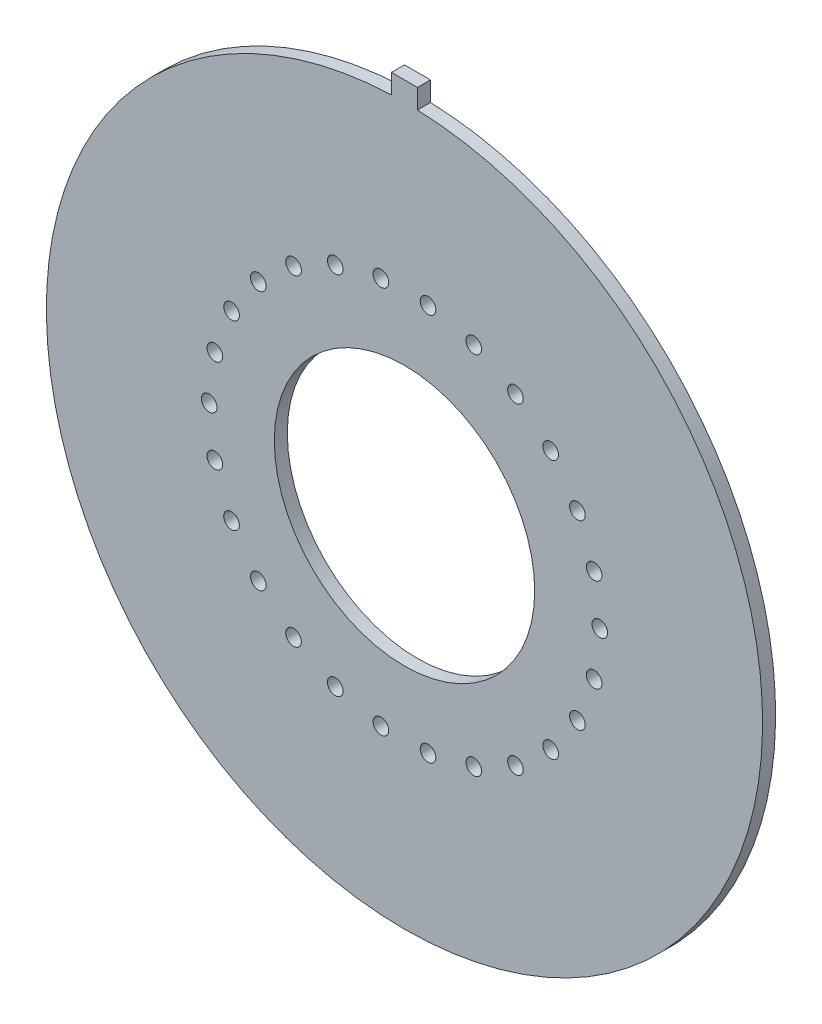
ISO-10303-21;
HEADER;
FILE_DESCRIPTION(('STEP AP214'),'2;1');
FILE_NAME('part.step','',(''),(''),'','','');
FILE_SCHEMA(('AUTOMOTIVE_DESIGN { 1 0 10303 214 1 1 1 1 }'));
ENDSEC;
DATA;
#1=APPLICATION_CONTEXT('core data for automotive mechanical design processes');
#2=APPLICATION_PROTOCOL_DEFINITION('international standard','automotive_design',2000,#1);
#3=PRODUCT_CONTEXT('',#1,'mechanical');
#4=PRODUCT('Part','Part','',(#3));
#5=PRODUCT_RELATED_PRODUCT_CATEGORY('part','',(#4));
#6=PRODUCT_DEFINITION_FORMATION('','',#4);
#7=PRODUCT_DEFINITION_CONTEXT('part definition',#1,'design');
#8=PRODUCT_DEFINITION('design','',#6,#7);
#9=PRODUCT_DEFINITION_SHAPE('','',#8);
#10=(LENGTH_UNIT() NAMED_UNIT(*) SI_UNIT(.MILLI.,.METRE.));
#11=(NAMED_UNIT(*) PLANE_ANGLE_UNIT() SI_UNIT($,.RADIAN.));
#12=(NAMED_UNIT(*) SI_UNIT($,.STERADIAN.) SOLID_ANGLE_UNIT());
#13=UNCERTAINTY_MEASURE_WITH_UNIT(LENGTH_MEASURE(1.E-05),#10,'distance_accuracy_value','');
#14=(GEOMETRIC_REPRESENTATION_CONTEXT(3) GLOBAL_UNCERTAINTY_ASSIGNED_CONTEXT((#13)) GLOBAL_UNIT_ASSIGNED_CONTEXT((#10,
#11,#12)) REPRESENTATION_CONTEXT('',''));
#15=CARTESIAN_POINT('',(0.,0.,0.));
#16=DIRECTION('',(0.,0.,1.));
#17=DIRECTION('',(1.,0.,0.));
#18=AXIS2_PLACEMENT_3D('',#15,#16,#17);
#19=CARTESIAN_POINT('',(0.,0.,1.));
#20=DIRECTION('',(0.,0.,1.));
#21=DIRECTION('',(1.,0.,0.));
#22=AXIS2_PLACEMENT_3D('',#19,#20,#21);
#23=PLANE('',#22);
#24=CARTESIAN_POINT('',(13.2818403847981,6.97084758065654,1.));
#25=DIRECTION('',(0.,0.,1.));
#26=DIRECTION('',(1.,0.,0.));
#27=AXIS2_PLACEMENT_3D('',#24,#25,#26);
#28=CIRCLE('',#27,0.600000000000002);
#29=CARTESIAN_POINT('',(13.8818403847981,6.97084758065654,1.));
#30=VERTEX_POINT('',#29);
#31=EDGE_CURVE('E258',#30,#30,#28,.T.);
#32=ORIENTED_EDGE('',*,*,#31,.F.);
#33=EDGE_LOOP('',(#32));
#34=FACE_BOUND('',#33,.T.);
#35=CARTESIAN_POINT('',(8.52097120096733,12.3447579884048,1.));
#36=DIRECTION('',(0.,0.,1.));
#37=DIRECTION('',(1.,0.,0.));
#38=AXIS2_PLACEMENT_3D('',#35,#36,#37);
#39=CIRCLE('',#38,0.6);
#40=CARTESIAN_POINT('',(9.12097120096733,12.3447579884048,1.));
#41=VERTEX_POINT('',#40);
#42=EDGE_CURVE('E246',#41,#41,#39,.T.);
#43=ORIENTED_EDGE('',*,*,#42,.F.);
#44=EDGE_LOOP('',(#43));
#45=FACE_BOUND('',#44,.T.);
#46=CARTESIAN_POINT('',(1.80805020382983,14.8906331114708,1.));
#47=DIRECTION('',(0.,0.,1.));
#48=DIRECTION('',(1.,0.,0.));
#49=AXIS2_PLACEMENT_3D('',#46,#47,#48);
#50=CIRCLE('',#49,0.599999999999963);
#51=CARTESIAN_POINT('',(2.4080502038298,14.8906331114708,1.));
#52=VERTEX_POINT('',#51);
#53=EDGE_CURVE('E234',#52,#52,#50,.T.);
#54=ORIENTED_EDGE('',*,*,#53,.F.);
#55=EDGE_LOOP('',(#54));
#56=FACE_BOUND('',#55,.T.);
#57=CARTESIAN_POINT('',(-5.31907330563804,14.0252436402812,1.));
#58=DIRECTION('',(0.,0.,1.));
#59=DIRECTION('',(1.,0.,0.));
#60=AXIS2_PLACEMENT_3D('',#57,#58,#59);
#61=CIRCLE('',#60,0.599999999999959);
#62=CARTESIAN_POINT('',(-4.71907330563808,14.0252436402812,1.));
#63=VERTEX_POINT('',#62);
#64=EDGE_CURVE('E222',#63,#63,#61,.T.);
#65=ORIENTED_EDGE('',*,*,#64,.F.);
#66=EDGE_LOOP('',(#65));
#67=FACE_BOUND('',#66,.T.);
#68=CARTESIAN_POINT('',(-11.2276612225665,9.94683987361192,1.));
#69=DIRECTION('',(0.,0.,1.));
#70=DIRECTION('',(1.,0.,0.));
#71=AXIS2_PLACEMENT_3D('',#68,#69,#70);
#72=CIRCLE('',#71,0.599999999999968);
#73=CARTESIAN_POINT('',(-10.6276612225666,9.94683987361192,1.));
#74=VERTEX_POINT('',#73);
#75=EDGE_CURVE('E210',#74,#74,#72,.T.);
#76=ORIENTED_EDGE('',*,*,#75,.F.);
#77=EDGE_LOOP('',(#76));
#78=FACE_BOUND('',#77,.T.);
#79=CARTESIAN_POINT('',(-14.5641272613908,3.58973496431336,1.));
#80=DIRECTION('',(0.,0.,1.));
#81=DIRECTION('',(1.,0.,0.));
#82=AXIS2_PLACEMENT_3D('',#79,#80,#81);
#83=CIRCLE('',#82,0.599999999999977);
#84=CARTESIAN_POINT('',(-13.9641272613908,3.58973496431336,1.));
#85=VERTEX_POINT('',#84);
#86=EDGE_CURVE('E198',#85,#85,#83,.T.);
#87=ORIENTED_EDGE('',*,*,#86,.F.);
#88=EDGE_LOOP('',(#87));
#89=FACE_BOUND('',#88,.T.);
#90=CARTESIAN_POINT('',(-14.5641272613908,-3.58973496431337,1.));
#91=DIRECTION('',(0.,0.,1.));
#92=DIRECTION('',(1.,0.,0.));
#93=AXIS2_PLACEMENT_3D('',#90,#91,#92);
#94=CIRCLE('',#93,0.599999999999973);
#95=CARTESIAN_POINT('',(-13.9641272613908,-3.58973496431337,1.));
#96=VERTEX_POINT('',#95);
#97=EDGE_CURVE('E186',#96,#96,#94,.T.);
#98=ORIENTED_EDGE('',*,*,#97,.F.);
#99=EDGE_LOOP('',(#98));
#100=FACE_BOUND('',#99,.T.);
#101=CARTESIAN_POINT('',(-11.2276612225665,-9.94683987361193,1.));
#102=DIRECTION('',(0.,0.,1.));
#103=DIRECTION('',(1.,0.,0.));
#104=AXIS2_PLACEMENT_3D('',#101,#102,#103);
#105=CIRCLE('',#104,0.599999999999982);
#106=CARTESIAN_POINT('',(-10.6276612225665,-9.94683987361193,1.));
#107=VERTEX_POINT('',#106);
#108=EDGE_CURVE('E174',#107,#107,#105,.T.);
#109=ORIENTED_EDGE('',*,*,#108,.F.);
#110=EDGE_LOOP('',(#109));
#111=FACE_BOUND('',#110,.T.);
#112=CARTESIAN_POINT('',(-5.31907330563803,-14.0252436402812,1.));
#113=DIRECTION('',(0.,0.,1.));
#114=DIRECTION('',(1.,0.,0.));
#115=AXIS2_PLACEMENT_3D('',#112,#113,#114);
#116=CIRCLE('',#115,0.599999999999981);
#117=CARTESIAN_POINT('',(-4.71907330563805,-14.0252436402812,1.));
#118=VERTEX_POINT('',#117);
#119=EDGE_CURVE('E162',#118,#118,#116,.T.);
#120=ORIENTED_EDGE('',*,*,#119,.F.);
#121=EDGE_LOOP('',(#120));
#122=FACE_BOUND('',#121,.T.);
#123=CARTESIAN_POINT('',(1.80805020382985,-14.8906331114708,1.));
#124=DIRECTION('',(0.,0.,1.));
#125=DIRECTION('',(1.,0.,0.));
#126=AXIS2_PLACEMENT_3D('',#123,#124,#125);
#127=CIRCLE('',#126,0.599999999999988);
#128=CARTESIAN_POINT('',(2.40805020382984,-14.8906331114708,1.));
#129=VERTEX_POINT('',#128);
#130=EDGE_CURVE('E150',#129,#129,#127,.T.);
#131=ORIENTED_EDGE('',*,*,#130,.F.);
#132=EDGE_LOOP('',(#131));
#133=FACE_BOUND('',#132,.T.);
#134=CARTESIAN_POINT('',(8.52097120096734,-12.3447579884048,1.));
#135=DIRECTION('',(0.,0.,1.));
#136=DIRECTION('',(1.,0.,0.));
#137=AXIS2_PLACEMENT_3D('',#134,#135,#136);
#138=CIRCLE('',#137,0.600000000000002);
#139=CARTESIAN_POINT('',(9.12097120096734,-12.3447579884048,1.));
#140=VERTEX_POINT('',#139);
#141=EDGE_CURVE('E138',#140,#140,#138,.T.);
#142=ORIENTED_EDGE('',*,*,#141,.F.);
#143=EDGE_LOOP('',(#142));
#144=FACE_BOUND('',#143,.T.);
#145=CARTESIAN_POINT('',(13.2818403847981,-6.97084758065653,1.));
#146=DIRECTION('',(0.,0.,1.));
#147=DIRECTION('',(1.,0.,0.));
#148=AXIS2_PLACEMENT_3D('',#145,#146,#147);
#149=CIRCLE('',#148,0.600000000000002);
#150=CARTESIAN_POINT('',(13.8818403847981,-6.97084758065653,1.));
#151=VERTEX_POINT('',#150);
#152=EDGE_CURVE('E126',#151,#151,#149,.T.);
#153=ORIENTED_EDGE('',*,*,#152,.F.);
#154=EDGE_LOOP('',(#153));
#155=FACE_BOUND('',#154,.T.);
#156=CARTESIAN_POINT('',(0.,0.,1.));
#157=DIRECTION('',(0.,0.,1.));
#158=DIRECTION('',(1.,0.,0.));
#159=AXIS2_PLACEMENT_3D('',#156,#157,#158);
#160=CIRCLE('',#159,10.);
#161=CARTESIAN_POINT('',(10.,0.,1.));
#162=VERTEX_POINT('',#161);
#163=EDGE_CURVE('E114',#162,#162,#160,.T.);
#164=ORIENTED_EDGE('',*,*,#163,.F.);
#165=EDGE_LOOP('',(#164));
#166=FACE_BOUND('',#165,.T.);
#167=CARTESIAN_POINT('',(0.,0.,1.));
#168=DIRECTION('',(0.,0.,1.));
#169=DIRECTION('',(1.,0.,0.));
#170=AXIS2_PLACEMENT_3D('',#167,#168,#169);
#171=CIRCLE('',#170,27.5);
#172=CARTESIAN_POINT('',(-1.,27.4818121673226,1.));
#173=VERTEX_POINT('',#172);
#174=CARTESIAN_POINT('',(1.,27.4818121673226,1.));
#175=VERTEX_POINT('',#174);
#176=EDGE_CURVE('E84',#173,#175,#171,.T.);
#177=ORIENTED_EDGE('',*,*,#176,.T.);
#178=DIRECTION('',(0.,1.,0.));
#179=VECTOR('',#178,1.);
#180=CARTESIAN_POINT('',(1.,28.9818121673226,1.));
#181=LINE('',#180,#179);
#182=CARTESIAN_POINT('',(1.,28.9818121673226,1.));
#183=VERTEX_POINT('',#182);
#184=EDGE_CURVE('E79',#175,#183,#181,.T.);
#185=ORIENTED_EDGE('',*,*,#184,.T.);
#186=DIRECTION('',(-1.,0.,0.));
#187=VECTOR('',#186,1.);
#188=CARTESIAN_POINT('',(-1.,28.9818121673226,1.));
#189=LINE('',#188,#187);
#190=CARTESIAN_POINT('',(-1.,28.9818121673226,1.));
#191=VERTEX_POINT('',#190);
#192=EDGE_CURVE('E82',#183,#191,#189,.T.);
#193=ORIENTED_EDGE('',*,*,#192,.T.);
#194=DIRECTION('',(0.,-1.,0.));
#195=VECTOR('',#194,1.);
#196=CARTESIAN_POINT('',(-1.,27.4818121673226,1.));
#197=LINE('',#196,#195);
#198=EDGE_CURVE('E49',#191,#173,#197,.T.);
#199=ORIENTED_EDGE('',*,*,#198,.T.);
#200=EDGE_LOOP('',(#177,#185,#193,#199));
#201=FACE_BOUND('',#200,.T.);
#202=CARTESIAN_POINT('',(15.,0.,1.));
#203=DIRECTION('',(0.,0.,1.));
#204=DIRECTION('',(1.,0.,0.));
#205=AXIS2_PLACEMENT_3D('',#202,#203,#204);
#206=CIRCLE('',#205,0.6);
#207=CARTESIAN_POINT('',(15.6,0.,1.));
#208=VERTEX_POINT('',#207);
#209=EDGE_CURVE('E99',#208,#208,#206,.T.);
#210=ORIENTED_EDGE('',*,*,#209,.F.);
#211=EDGE_LOOP('',(#210));
#212=FACE_BOUND('',#211,.T.);
#213=CARTESIAN_POINT('',(14.5641272613908,-3.58973496431336,1.));
#214=DIRECTION('',(0.,0.,1.));
#215=DIRECTION('',(1.,0.,0.));
#216=AXIS2_PLACEMENT_3D('',#213,#214,#215);
#217=CIRCLE('',#216,0.600000000000002);
#218=CARTESIAN_POINT('',(15.1641272613908,-3.58973496431336,1.));
#219=VERTEX_POINT('',#218);
#220=EDGE_CURVE('E120',#219,#219,#217,.T.);
#221=ORIENTED_EDGE('',*,*,#220,.F.);
#222=EDGE_LOOP('',(#221));
#223=FACE_BOUND('',#222,.T.);
#224=CARTESIAN_POINT('',(11.2276612225665,-9.94683987361193,1.));
#225=DIRECTION('',(0.,0.,1.));
#226=DIRECTION('',(1.,0.,0.));
#227=AXIS2_PLACEMENT_3D('',#224,#225,#226);
#228=CIRCLE('',#227,0.6);
#229=CARTESIAN_POINT('',(11.8276612225665,-9.94683987361193,1.));
#230=VERTEX_POINT('',#229);
#231=EDGE_CURVE('E132',#230,#230,#228,.T.);
#232=ORIENTED_EDGE('',*,*,#231,.F.);
#233=EDGE_LOOP('',(#232));
#234=FACE_BOUND('',#233,.T.);
#235=CARTESIAN_POINT('',(5.31907330563804,-14.0252436402812,1.));
#236=DIRECTION('',(0.,0.,1.));
#237=DIRECTION('',(1.,0.,0.));
#238=AXIS2_PLACEMENT_3D('',#235,#236,#237);
#239=CIRCLE('',#238,0.6);
#240=CARTESIAN_POINT('',(5.91907330563804,-14.0252436402812,1.));
#241=VERTEX_POINT('',#240);
#242=EDGE_CURVE('E144',#241,#241,#239,.T.);
#243=ORIENTED_EDGE('',*,*,#242,.F.);
#244=EDGE_LOOP('',(#243));
#245=FACE_BOUND('',#244,.T.);
#246=CARTESIAN_POINT('',(-1.80805020382984,-14.8906331114708,1.));
#247=DIRECTION('',(0.,0.,1.));
#248=DIRECTION('',(1.,0.,0.));
#249=AXIS2_PLACEMENT_3D('',#246,#247,#248);
#250=CIRCLE('',#249,0.599999999999983);
#251=CARTESIAN_POINT('',(-1.20805020382986,-14.8906331114708,1.));
#252=VERTEX_POINT('',#251);
#253=EDGE_CURVE('E156',#252,#252,#250,.T.);
#254=ORIENTED_EDGE('',*,*,#253,.F.);
#255=EDGE_LOOP('',(#254));
#256=FACE_BOUND('',#255,.T.);
#257=CARTESIAN_POINT('',(-8.52097120096733,-12.3447579884048,1.));
#258=DIRECTION('',(0.,0.,1.));
#259=DIRECTION('',(1.,0.,0.));
#260=AXIS2_PLACEMENT_3D('',#257,#258,#259);
#261=CIRCLE('',#260,0.599999999999979);
#262=CARTESIAN_POINT('',(-7.92097120096736,-12.3447579884048,1.));
#263=VERTEX_POINT('',#262);
#264=EDGE_CURVE('E168',#263,#263,#261,.T.);
#265=ORIENTED_EDGE('',*,*,#264,.F.);
#266=EDGE_LOOP('',(#265));
#267=FACE_BOUND('',#266,.T.);
#268=CARTESIAN_POINT('',(-13.2818403847981,-6.97084758065653,1.));
#269=DIRECTION('',(0.,0.,1.));
#270=DIRECTION('',(1.,0.,0.));
#271=AXIS2_PLACEMENT_3D('',#268,#269,#270);
#272=CIRCLE('',#271,0.59999999999998);
#273=CARTESIAN_POINT('',(-12.6818403847982,-6.97084758065653,1.));
#274=VERTEX_POINT('',#273);
#275=EDGE_CURVE('E180',#274,#274,#272,.T.);
#276=ORIENTED_EDGE('',*,*,#275,.F.);
#277=EDGE_LOOP('',(#276));
#278=FACE_BOUND('',#277,.T.);
#279=CARTESIAN_POINT('',(-15.,0.,1.));
#280=DIRECTION('',(0.,0.,1.));
#281=DIRECTION('',(1.,0.,0.));
#282=AXIS2_PLACEMENT_3D('',#279,#280,#281);
#283=CIRCLE('',#282,0.599999999999973);
#284=CARTESIAN_POINT('',(-14.4,0.,1.));
#285=VERTEX_POINT('',#284);
#286=EDGE_CURVE('E192',#285,#285,#283,.T.);
#287=ORIENTED_EDGE('',*,*,#286,.F.);
#288=EDGE_LOOP('',(#287));
#289=FACE_BOUND('',#288,.T.);
#290=CARTESIAN_POINT('',(-13.2818403847981,6.97084758065653,1.));
#291=DIRECTION('',(0.,0.,1.));
#292=DIRECTION('',(1.,0.,0.));
#293=AXIS2_PLACEMENT_3D('',#290,#291,#292);
#294=CIRCLE('',#293,0.599999999999973);
#295=CARTESIAN_POINT('',(-12.6818403847982,6.97084758065653,1.));
#296=VERTEX_POINT('',#295);
#297=EDGE_CURVE('E204',#296,#296,#294,.T.);
#298=ORIENTED_EDGE('',*,*,#297,.F.);
#299=EDGE_LOOP('',(#298));
#300=FACE_BOUND('',#299,.T.);
#301=CARTESIAN_POINT('',(-8.52097120096734,12.3447579884048,1.));
#302=DIRECTION('',(0.,0.,1.));
#303=DIRECTION('',(1.,0.,0.));
#304=AXIS2_PLACEMENT_3D('',#301,#302,#303);
#305=CIRCLE('',#304,0.599999999999966);
#306=CARTESIAN_POINT('',(-7.92097120096737,12.3447579884048,1.));
#307=VERTEX_POINT('',#306);
#308=EDGE_CURVE('E216',#307,#307,#305,.T.);
#309=ORIENTED_EDGE('',*,*,#308,.F.);
#310=EDGE_LOOP('',(#309));
#311=FACE_BOUND('',#310,.T.);
#312=CARTESIAN_POINT('',(-1.80805020382985,14.8906331114708,1.));
#313=DIRECTION('',(0.,0.,1.));
#314=DIRECTION('',(1.,0.,0.));
#315=AXIS2_PLACEMENT_3D('',#312,#313,#314);
#316=CIRCLE('',#315,0.599999999999966);
#317=CARTESIAN_POINT('',(-1.20805020382989,14.8906331114708,1.));
#318=VERTEX_POINT('',#317);
#319=EDGE_CURVE('E228',#318,#318,#316,.T.);
#320=ORIENTED_EDGE('',*,*,#319,.F.);
#321=EDGE_LOOP('',(#320));
#322=FACE_BOUND('',#321,.T.);
#323=CARTESIAN_POINT('',(5.31907330563803,14.0252436402812,1.));
#324=DIRECTION('',(0.,0.,1.));
#325=DIRECTION('',(1.,0.,0.));
#326=AXIS2_PLACEMENT_3D('',#323,#324,#325);
#327=CIRCLE('',#326,0.6);
#328=CARTESIAN_POINT('',(5.91907330563803,14.0252436402812,1.));
#329=VERTEX_POINT('',#328);
#330=EDGE_CURVE('E240',#329,#329,#327,.T.);
#331=ORIENTED_EDGE('',*,*,#330,.F.);
#332=EDGE_LOOP('',(#331));
#333=FACE_BOUND('',#332,.T.);
#334=CARTESIAN_POINT('',(11.2276612225665,9.94683987361193,1.));
#335=DIRECTION('',(0.,0.,1.));
#336=DIRECTION('',(1.,0.,0.));
#337=AXIS2_PLACEMENT_3D('',#334,#335,#336);
#338=CIRCLE('',#337,0.6);
#339=CARTESIAN_POINT('',(11.8276612225665,9.94683987361193,1.));
#340=VERTEX_POINT('',#339);
#341=EDGE_CURVE('E252',#340,#340,#338,.T.);
#342=ORIENTED_EDGE('',*,*,#341,.F.);
#343=EDGE_LOOP('',(#342));
#344=FACE_BOUND('',#343,.T.);
#345=CARTESIAN_POINT('',(14.5641272613908,3.58973496431338,1.));
#346=DIRECTION('',(0.,0.,1.));
#347=DIRECTION('',(1.,0.,0.));
#348=AXIS2_PLACEMENT_3D('',#345,#346,#347);
#349=CIRCLE('',#348,0.600000000000002);
#350=CARTESIAN_POINT('',(15.1641272613908,3.58973496431338,1.));
#351=VERTEX_POINT('',#350);
#352=EDGE_CURVE('E264',#351,#351,#349,.T.);
#353=ORIENTED_EDGE('',*,*,#352,.F.);
#354=EDGE_LOOP('',(#353));
#355=FACE_BOUND('',#354,.T.);
#356=ADVANCED_FACE('F32',(#34,#45,#56,#67,#78,#89,#100,#111,#122,#133,#144,#155,#166,#201,#212,
#223,#234,#245,#256,#267,#278,#289,#300,#311,#322,#333,#344,#355),#23,.T.);
#357=CARTESIAN_POINT('',(0.,0.,0.));
#358=DIRECTION('',(0.,0.,1.));
#359=DIRECTION('',(1.,0.,0.));
#360=AXIS2_PLACEMENT_3D('',#357,#358,#359);
#361=PLANE('',#360);
#362=CARTESIAN_POINT('',(13.2818403847981,6.97084758065654,0.));
#363=DIRECTION('',(0.,0.,1.));
#364=DIRECTION('',(1.,0.,0.));
#365=AXIS2_PLACEMENT_3D('',#362,#363,#364);
#366=CIRCLE('',#365,0.600000000000002);
#367=CARTESIAN_POINT('',(13.8818403847981,6.97084758065654,0.));
#368=VERTEX_POINT('',#367);
#369=EDGE_CURVE('E261',#368,#368,#366,.T.);
#370=ORIENTED_EDGE('',*,*,#369,.T.);
#371=EDGE_LOOP('',(#370));
#372=FACE_BOUND('',#371,.T.);
#373=CARTESIAN_POINT('',(8.52097120096733,12.3447579884048,0.));
#374=DIRECTION('',(0.,0.,1.));
#375=DIRECTION('',(1.,0.,0.));
#376=AXIS2_PLACEMENT_3D('',#373,#374,#375);
#377=CIRCLE('',#376,0.6);
#378=CARTESIAN_POINT('',(9.12097120096733,12.3447579884048,0.));
#379=VERTEX_POINT('',#378);
#380=EDGE_CURVE('E249',#379,#379,#377,.T.);
#381=ORIENTED_EDGE('',*,*,#380,.T.);
#382=EDGE_LOOP('',(#381));
#383=FACE_BOUND('',#382,.T.);
#384=CARTESIAN_POINT('',(1.80805020382983,14.8906331114708,0.));
#385=DIRECTION('',(0.,0.,1.));
#386=DIRECTION('',(1.,0.,0.));
#387=AXIS2_PLACEMENT_3D('',#384,#385,#386);
#388=CIRCLE('',#387,0.599999999999963);
#389=CARTESIAN_POINT('',(2.4080502038298,14.8906331114708,0.));
#390=VERTEX_POINT('',#389);
#391=EDGE_CURVE('E237',#390,#390,#388,.T.);
#392=ORIENTED_EDGE('',*,*,#391,.T.);
#393=EDGE_LOOP('',(#392));
#394=FACE_BOUND('',#393,.T.);
#395=CARTESIAN_POINT('',(-5.31907330563804,14.0252436402812,0.));
#396=DIRECTION('',(0.,0.,1.));
#397=DIRECTION('',(1.,0.,0.));
#398=AXIS2_PLACEMENT_3D('',#395,#396,#397);
#399=CIRCLE('',#398,0.599999999999959);
#400=CARTESIAN_POINT('',(-4.71907330563808,14.0252436402812,0.));
#401=VERTEX_POINT('',#400);
#402=EDGE_CURVE('E225',#401,#401,#399,.T.);
#403=ORIENTED_EDGE('',*,*,#402,.T.);
#404=EDGE_LOOP('',(#403));
#405=FACE_BOUND('',#404,.T.);
#406=CARTESIAN_POINT('',(-11.2276612225665,9.94683987361192,0.));
#407=DIRECTION('',(0.,0.,1.));
#408=DIRECTION('',(1.,0.,0.));
#409=AXIS2_PLACEMENT_3D('',#406,#407,#408);
#410=CIRCLE('',#409,0.599999999999968);
#411=CARTESIAN_POINT('',(-10.6276612225666,9.94683987361192,0.));
#412=VERTEX_POINT('',#411);
#413=EDGE_CURVE('E213',#412,#412,#410,.T.);
#414=ORIENTED_EDGE('',*,*,#413,.T.);
#415=EDGE_LOOP('',(#414));
#416=FACE_BOUND('',#415,.T.);
#417=CARTESIAN_POINT('',(-14.5641272613908,3.58973496431336,0.));
#418=DIRECTION('',(0.,0.,1.));
#419=DIRECTION('',(1.,0.,0.));
#420=AXIS2_PLACEMENT_3D('',#417,#418,#419);
#421=CIRCLE('',#420,0.599999999999977);
#422=CARTESIAN_POINT('',(-13.9641272613908,3.58973496431336,0.));
#423=VERTEX_POINT('',#422);
#424=EDGE_CURVE('E201',#423,#423,#421,.T.);
#425=ORIENTED_EDGE('',*,*,#424,.T.);
#426=EDGE_LOOP('',(#425));
#427=FACE_BOUND('',#426,.T.);
#428=CARTESIAN_POINT('',(-14.5641272613908,-3.58973496431337,0.));
#429=DIRECTION('',(0.,0.,1.));
#430=DIRECTION('',(1.,0.,0.));
#431=AXIS2_PLACEMENT_3D('',#428,#429,#430);
#432=CIRCLE('',#431,0.599999999999973);
#433=CARTESIAN_POINT('',(-13.9641272613908,-3.58973496431337,0.));
#434=VERTEX_POINT('',#433);
#435=EDGE_CURVE('E189',#434,#434,#432,.T.);
#436=ORIENTED_EDGE('',*,*,#435,.T.);
#437=EDGE_LOOP('',(#436));
#438=FACE_BOUND('',#437,.T.);
#439=CARTESIAN_POINT('',(-11.2276612225665,-9.94683987361193,0.));
#440=DIRECTION('',(0.,0.,1.));
#441=DIRECTION('',(1.,0.,0.));
#442=AXIS2_PLACEMENT_3D('',#439,#440,#441);
#443=CIRCLE('',#442,0.599999999999982);
#444=CARTESIAN_POINT('',(-10.6276612225665,-9.94683987361193,0.));
#445=VERTEX_POINT('',#444);
#446=EDGE_CURVE('E177',#445,#445,#443,.T.);
#447=ORIENTED_EDGE('',*,*,#446,.T.);
#448=EDGE_LOOP('',(#447));
#449=FACE_BOUND('',#448,.T.);
#450=CARTESIAN_POINT('',(-5.31907330563803,-14.0252436402812,0.));
#451=DIRECTION('',(0.,0.,1.));
#452=DIRECTION('',(1.,0.,0.));
#453=AXIS2_PLACEMENT_3D('',#450,#451,#452);
#454=CIRCLE('',#453,0.599999999999981);
#455=CARTESIAN_POINT('',(-4.71907330563805,-14.0252436402812,0.));
#456=VERTEX_POINT('',#455);
#457=EDGE_CURVE('E165',#456,#456,#454,.T.);
#458=ORIENTED_EDGE('',*,*,#457,.T.);
#459=EDGE_LOOP('',(#458));
#460=FACE_BOUND('',#459,.T.);
#461=CARTESIAN_POINT('',(1.80805020382985,-14.8906331114708,0.));
#462=DIRECTION('',(0.,0.,1.));
#463=DIRECTION('',(1.,0.,0.));
#464=AXIS2_PLACEMENT_3D('',#461,#462,#463);
#465=CIRCLE('',#464,0.599999999999988);
#466=CARTESIAN_POINT('',(2.40805020382984,-14.8906331114708,0.));
#467=VERTEX_POINT('',#466);
#468=EDGE_CURVE('E153',#467,#467,#465,.T.);
#469=ORIENTED_EDGE('',*,*,#468,.T.);
#470=EDGE_LOOP('',(#469));
#471=FACE_BOUND('',#470,.T.);
#472=CARTESIAN_POINT('',(8.52097120096734,-12.3447579884048,0.));
#473=DIRECTION('',(0.,0.,1.));
#474=DIRECTION('',(1.,0.,0.));
#475=AXIS2_PLACEMENT_3D('',#472,#473,#474);
#476=CIRCLE('',#475,0.600000000000002);
#477=CARTESIAN_POINT('',(9.12097120096734,-12.3447579884048,0.));
#478=VERTEX_POINT('',#477);
#479=EDGE_CURVE('E141',#478,#478,#476,.T.);
#480=ORIENTED_EDGE('',*,*,#479,.T.);
#481=EDGE_LOOP('',(#480));
#482=FACE_BOUND('',#481,.T.);
#483=CARTESIAN_POINT('',(13.2818403847981,-6.97084758065653,0.));
#484=DIRECTION('',(0.,0.,1.));
#485=DIRECTION('',(1.,0.,0.));
#486=AXIS2_PLACEMENT_3D('',#483,#484,#485);
#487=CIRCLE('',#486,0.600000000000002);
#488=CARTESIAN_POINT('',(13.8818403847981,-6.97084758065653,0.));
#489=VERTEX_POINT('',#488);
#490=EDGE_CURVE('E129',#489,#489,#487,.T.);
#491=ORIENTED_EDGE('',*,*,#490,.T.);
#492=EDGE_LOOP('',(#491));
#493=FACE_BOUND('',#492,.T.);
#494=CARTESIAN_POINT('',(0.,0.,0.));
#495=DIRECTION('',(0.,0.,1.));
#496=DIRECTION('',(1.,0.,0.));
#497=AXIS2_PLACEMENT_3D('',#494,#495,#496);
#498=CIRCLE('',#497,10.);
#499=CARTESIAN_POINT('',(10.,0.,0.));
#500=VERTEX_POINT('',#499);
#501=EDGE_CURVE('E117',#500,#500,#498,.T.);
#502=ORIENTED_EDGE('',*,*,#501,.T.);
#503=EDGE_LOOP('',(#502));
#504=FACE_BOUND('',#503,.T.);
#505=CARTESIAN_POINT('',(0.,0.,0.));
#506=DIRECTION('',(0.,0.,1.));
#507=DIRECTION('',(1.,0.,0.));
#508=AXIS2_PLACEMENT_3D('',#505,#506,#507);
#509=CIRCLE('',#508,27.5);
#510=CARTESIAN_POINT('',(-1.,27.4818121673226,0.));
#511=VERTEX_POINT('',#510);
#512=CARTESIAN_POINT('',(1.,27.4818121673226,0.));
#513=VERTEX_POINT('',#512);
#514=EDGE_CURVE('E96',#511,#513,#509,.T.);
#515=ORIENTED_EDGE('',*,*,#514,.F.);
#516=DIRECTION('',(0.,-1.,0.));
#517=VECTOR('',#516,1.);
#518=CARTESIAN_POINT('',(-1.,27.4818121673226,0.));
#519=LINE('',#518,#517);
#520=CARTESIAN_POINT('',(-1.,28.9818121673226,0.));
#521=VERTEX_POINT('',#520);
#522=EDGE_CURVE('E72',#521,#511,#519,.T.);
#523=ORIENTED_EDGE('',*,*,#522,.F.);
#524=DIRECTION('',(-1.,0.,0.));
#525=VECTOR('',#524,1.);
#526=CARTESIAN_POINT('',(-1.,28.9818121673226,0.));
#527=LINE('',#526,#525);
#528=CARTESIAN_POINT('',(1.,28.9818121673226,0.));
#529=VERTEX_POINT('',#528);
#530=EDGE_CURVE('E66',#529,#521,#527,.T.);
#531=ORIENTED_EDGE('',*,*,#530,.F.);
#532=DIRECTION('',(0.,1.,0.));
#533=VECTOR('',#532,1.);
#534=CARTESIAN_POINT('',(1.,28.9818121673226,0.));
#535=LINE('',#534,#533);
#536=EDGE_CURVE('E88',#513,#529,#535,.T.);
#537=ORIENTED_EDGE('',*,*,#536,.F.);
#538=EDGE_LOOP('',(#515,#523,#531,#537));
#539=FACE_BOUND('',#538,.T.);
#540=CARTESIAN_POINT('',(15.,0.,0.));
#541=DIRECTION('',(0.,0.,1.));
#542=DIRECTION('',(1.,0.,0.));
#543=AXIS2_PLACEMENT_3D('',#540,#541,#542);
#544=CIRCLE('',#543,0.6);
#545=CARTESIAN_POINT('',(15.6,0.,0.));
#546=VERTEX_POINT('',#545);
#547=EDGE_CURVE('E111',#546,#546,#544,.T.);
#548=ORIENTED_EDGE('',*,*,#547,.T.);
#549=EDGE_LOOP('',(#548));
#550=FACE_BOUND('',#549,.T.);
#551=CARTESIAN_POINT('',(14.5641272613908,-3.58973496431336,0.));
#552=DIRECTION('',(0.,0.,1.));
#553=DIRECTION('',(1.,0.,0.));
#554=AXIS2_PLACEMENT_3D('',#551,#552,#553);
#555=CIRCLE('',#554,0.600000000000002);
#556=CARTESIAN_POINT('',(15.1641272613908,-3.58973496431336,0.));
#557=VERTEX_POINT('',#556);
#558=EDGE_CURVE('E123',#557,#557,#555,.T.);
#559=ORIENTED_EDGE('',*,*,#558,.T.);
#560=EDGE_LOOP('',(#559));
#561=FACE_BOUND('',#560,.T.);
#562=CARTESIAN_POINT('',(11.2276612225665,-9.94683987361193,0.));
#563=DIRECTION('',(0.,0.,1.));
#564=DIRECTION('',(1.,0.,0.));
#565=AXIS2_PLACEMENT_3D('',#562,#563,#564);
#566=CIRCLE('',#565,0.6);
#567=CARTESIAN_POINT('',(11.8276612225665,-9.94683987361193,0.));
#568=VERTEX_POINT('',#567);
#569=EDGE_CURVE('E135',#568,#568,#566,.T.);
#570=ORIENTED_EDGE('',*,*,#569,.T.);
#571=EDGE_LOOP('',(#570));
#572=FACE_BOUND('',#571,.T.);
#573=CARTESIAN_POINT('',(5.31907330563804,-14.0252436402812,0.));
#574=DIRECTION('',(0.,0.,1.));
#575=DIRECTION('',(1.,0.,0.));
#576=AXIS2_PLACEMENT_3D('',#573,#574,#575);
#577=CIRCLE('',#576,0.6);
#578=CARTESIAN_POINT('',(5.91907330563804,-14.0252436402812,0.));
#579=VERTEX_POINT('',#578);
#580=EDGE_CURVE('E147',#579,#579,#577,.T.);
#581=ORIENTED_EDGE('',*,*,#580,.T.);
#582=EDGE_LOOP('',(#581));
#583=FACE_BOUND('',#582,.T.);
#584=CARTESIAN_POINT('',(-1.80805020382984,-14.8906331114708,0.));
#585=DIRECTION('',(0.,0.,1.));
#586=DIRECTION('',(1.,0.,0.));
#587=AXIS2_PLACEMENT_3D('',#584,#585,#586);
#588=CIRCLE('',#587,0.599999999999983);
#589=CARTESIAN_POINT('',(-1.20805020382986,-14.8906331114708,0.));
#590=VERTEX_POINT('',#589);
#591=EDGE_CURVE('E159',#590,#590,#588,.T.);
#592=ORIENTED_EDGE('',*,*,#591,.T.);
#593=EDGE_LOOP('',(#592));
#594=FACE_BOUND('',#593,.T.);
#595=CARTESIAN_POINT('',(-8.52097120096733,-12.3447579884048,0.));
#596=DIRECTION('',(0.,0.,1.));
#597=DIRECTION('',(1.,0.,0.));
#598=AXIS2_PLACEMENT_3D('',#595,#596,#597);
#599=CIRCLE('',#598,0.599999999999979);
#600=CARTESIAN_POINT('',(-7.92097120096736,-12.3447579884048,0.));
#601=VERTEX_POINT('',#600);
#602=EDGE_CURVE('E171',#601,#601,#599,.T.);
#603=ORIENTED_EDGE('',*,*,#602,.T.);
#604=EDGE_LOOP('',(#603));
#605=FACE_BOUND('',#604,.T.);
#606=CARTESIAN_POINT('',(-13.2818403847981,-6.97084758065653,0.));
#607=DIRECTION('',(0.,0.,1.));
#608=DIRECTION('',(1.,0.,0.));
#609=AXIS2_PLACEMENT_3D('',#606,#607,#608);
#610=CIRCLE('',#609,0.59999999999998);
#611=CARTESIAN_POINT('',(-12.6818403847982,-6.97084758065653,0.));
#612=VERTEX_POINT('',#611);
#613=EDGE_CURVE('E183',#612,#612,#610,.T.);
#614=ORIENTED_EDGE('',*,*,#613,.T.);
#615=EDGE_LOOP('',(#614));
#616=FACE_BOUND('',#615,.T.);
#617=CARTESIAN_POINT('',(-15.,0.,0.));
#618=DIRECTION('',(0.,0.,1.));
#619=DIRECTION('',(1.,0.,0.));
#620=AXIS2_PLACEMENT_3D('',#617,#618,#619);
#621=CIRCLE('',#620,0.599999999999973);
#622=CARTESIAN_POINT('',(-14.4,0.,0.));
#623=VERTEX_POINT('',#622);
#624=EDGE_CURVE('E195',#623,#623,#621,.T.);
#625=ORIENTED_EDGE('',*,*,#624,.T.);
#626=EDGE_LOOP('',(#625));
#627=FACE_BOUND('',#626,.T.);
#628=CARTESIAN_POINT('',(-13.2818403847981,6.97084758065653,0.));
#629=DIRECTION('',(0.,0.,1.));
#630=DIRECTION('',(1.,0.,0.));
#631=AXIS2_PLACEMENT_3D('',#628,#629,#630);
#632=CIRCLE('',#631,0.599999999999973);
#633=CARTESIAN_POINT('',(-12.6818403847982,6.97084758065653,0.));
#634=VERTEX_POINT('',#633);
#635=EDGE_CURVE('E207',#634,#634,#632,.T.);
#636=ORIENTED_EDGE('',*,*,#635,.T.);
#637=EDGE_LOOP('',(#636));
#638=FACE_BOUND('',#637,.T.);
#639=CARTESIAN_POINT('',(-8.52097120096734,12.3447579884048,0.));
#640=DIRECTION('',(0.,0.,1.));
#641=DIRECTION('',(1.,0.,0.));
#642=AXIS2_PLACEMENT_3D('',#639,#640,#641);
#643=CIRCLE('',#642,0.599999999999966);
#644=CARTESIAN_POINT('',(-7.92097120096737,12.3447579884048,0.));
#645=VERTEX_POINT('',#644);
#646=EDGE_CURVE('E219',#645,#645,#643,.T.);
#647=ORIENTED_EDGE('',*,*,#646,.T.);
#648=EDGE_LOOP('',(#647));
#649=FACE_BOUND('',#648,.T.);
#650=CARTESIAN_POINT('',(-1.80805020382985,14.8906331114708,0.));
#651=DIRECTION('',(0.,0.,1.));
#652=DIRECTION('',(1.,0.,0.));
#653=AXIS2_PLACEMENT_3D('',#650,#651,#652);
#654=CIRCLE('',#653,0.599999999999966);
#655=CARTESIAN_POINT('',(-1.20805020382989,14.8906331114708,0.));
#656=VERTEX_POINT('',#655);
#657=EDGE_CURVE('E231',#656,#656,#654,.T.);
#658=ORIENTED_EDGE('',*,*,#657,.T.);
#659=EDGE_LOOP('',(#658));
#660=FACE_BOUND('',#659,.T.);
#661=CARTESIAN_POINT('',(5.31907330563803,14.0252436402812,0.));
#662=DIRECTION('',(0.,0.,1.));
#663=DIRECTION('',(1.,0.,0.));
#664=AXIS2_PLACEMENT_3D('',#661,#662,#663);
#665=CIRCLE('',#664,0.6);
#666=CARTESIAN_POINT('',(5.91907330563803,14.0252436402812,0.));
#667=VERTEX_POINT('',#666);
#668=EDGE_CURVE('E243',#667,#667,#665,.T.);
#669=ORIENTED_EDGE('',*,*,#668,.T.);
#670=EDGE_LOOP('',(#669));
#671=FACE_BOUND('',#670,.T.);
#672=CARTESIAN_POINT('',(11.2276612225665,9.94683987361193,0.));
#673=DIRECTION('',(0.,0.,1.));
#674=DIRECTION('',(1.,0.,0.));
#675=AXIS2_PLACEMENT_3D('',#672,#673,#674);
#676=CIRCLE('',#675,0.6);
#677=CARTESIAN_POINT('',(11.8276612225665,9.94683987361193,0.));
#678=VERTEX_POINT('',#677);
#679=EDGE_CURVE('E255',#678,#678,#676,.T.);
#680=ORIENTED_EDGE('',*,*,#679,.T.);
#681=EDGE_LOOP('',(#680));
#682=FACE_BOUND('',#681,.T.);
#683=CARTESIAN_POINT('',(14.5641272613908,3.58973496431338,0.));
#684=DIRECTION('',(0.,0.,1.));
#685=DIRECTION('',(1.,0.,0.));
#686=AXIS2_PLACEMENT_3D('',#683,#684,#685);
#687=CIRCLE('',#686,0.600000000000002);
#688=CARTESIAN_POINT('',(15.1641272613908,3.58973496431338,0.));
#689=VERTEX_POINT('',#688);
#690=EDGE_CURVE('E267',#689,#689,#687,.T.);
#691=ORIENTED_EDGE('',*,*,#690,.T.);
#692=EDGE_LOOP('',(#691));
#693=FACE_BOUND('',#692,.T.);
#694=ADVANCED_FACE('F107',(#372,#383,#394,#405,#416,#427,#438,#449,#460,#471,#482,#493,#504,
#539,#550,#561,#572,#583,#594,#605,#616,#627,#638,#649,#660,#671,#682,#693),#361,.F.);
#695=CARTESIAN_POINT('',(0.,0.,1.));
#696=DIRECTION('',(0.,0.,-1.));
#697=DIRECTION('',(-1.,0.,0.));
#698=AXIS2_PLACEMENT_3D('',#695,#696,#697);
#699=CYLINDRICAL_SURFACE('',#698,27.5);
#700=ORIENTED_EDGE('',*,*,#514,.T.);
#701=DIRECTION('',(0.,0.,-1.));
#702=VECTOR('',#701,1.);
#703=CARTESIAN_POINT('',(1.,27.4818121673226,1.));
#704=LINE('',#703,#702);
#705=EDGE_CURVE('E11',#175,#513,#704,.T.);
#706=ORIENTED_EDGE('',*,*,#705,.F.);
#707=ORIENTED_EDGE('',*,*,#176,.F.);
#708=DIRECTION('',(0.,0.,-1.));
#709=VECTOR('',#708,1.);
#710=CARTESIAN_POINT('',(-1.,27.4818121673226,1.));
#711=LINE('',#710,#709);
#712=EDGE_CURVE('E92',#173,#511,#711,.T.);
#713=ORIENTED_EDGE('',*,*,#712,.T.);
#714=EDGE_LOOP('',(#700,#706,#707,#713));
#715=FACE_BOUND('',#714,.T.);
#716=ADVANCED_FACE('F34',(#715),#699,.T.);
#717=CARTESIAN_POINT('',(1.,28.9818121673226,1.));
#718=DIRECTION('',(-1.,0.,0.));
#719=DIRECTION('',(0.,0.,1.));
#720=AXIS2_PLACEMENT_3D('',#717,#718,#719);
#721=PLANE('',#720);
#722=ORIENTED_EDGE('',*,*,#536,.T.);
#723=DIRECTION('',(0.,0.,-1.));
#724=VECTOR('',#723,1.);
#725=CARTESIAN_POINT('',(1.,28.9818121673226,1.));
#726=LINE('',#725,#724);
#727=EDGE_CURVE('E41',#183,#529,#726,.T.);
#728=ORIENTED_EDGE('',*,*,#727,.F.);
#729=ORIENTED_EDGE('',*,*,#184,.F.);
#730=ORIENTED_EDGE('',*,*,#705,.T.);
#731=EDGE_LOOP('',(#722,#728,#729,#730));
#732=FACE_BOUND('',#731,.T.);
#733=ADVANCED_FACE('F87',(#732),#721,.F.);
#734=CARTESIAN_POINT('',(-1.,28.9818121673226,1.));
#735=DIRECTION('',(0.,-1.,0.));
#736=DIRECTION('',(0.,0.,-1.));
#737=AXIS2_PLACEMENT_3D('',#734,#735,#736);
#738=PLANE('',#737);
#739=ORIENTED_EDGE('',*,*,#530,.T.);
#740=DIRECTION('',(0.,0.,-1.));
#741=VECTOR('',#740,1.);
#742=CARTESIAN_POINT('',(-1.,28.9818121673226,1.));
#743=LINE('',#742,#741);
#744=EDGE_CURVE('E89',#191,#521,#743,.T.);
#745=ORIENTED_EDGE('',*,*,#744,.F.);
#746=ORIENTED_EDGE('',*,*,#192,.F.);
#747=ORIENTED_EDGE('',*,*,#727,.T.);
#748=EDGE_LOOP('',(#739,#745,#746,#747));
#749=FACE_BOUND('',#748,.T.);
#750=ADVANCED_FACE('F90',(#749),#738,.F.);
#751=CARTESIAN_POINT('',(-1.,27.4818121673226,1.));
#752=DIRECTION('',(1.,0.,0.));
#753=DIRECTION('',(0.,1.,0.));
#754=AXIS2_PLACEMENT_3D('',#751,#752,#753);
#755=PLANE('',#754);
#756=ORIENTED_EDGE('',*,*,#522,.T.);
#757=ORIENTED_EDGE('',*,*,#712,.F.);
#758=ORIENTED_EDGE('',*,*,#198,.F.);
#759=ORIENTED_EDGE('',*,*,#744,.T.);
#760=EDGE_LOOP('',(#756,#757,#758,#759));
#761=FACE_BOUND('',#760,.T.);
#762=ADVANCED_FACE('F104',(#761),#755,.F.);
#763=CARTESIAN_POINT('',(15.,0.,1.));
#764=DIRECTION('',(0.,0.,-1.));
#765=DIRECTION('',(-1.,0.,0.));
#766=AXIS2_PLACEMENT_3D('',#763,#764,#765);
#767=CYLINDRICAL_SURFACE('',#766,0.6);
#768=ORIENTED_EDGE('',*,*,#209,.T.);
#769=EDGE_LOOP('',(#768));
#770=FACE_BOUND('',#769,.T.);
#771=ORIENTED_EDGE('',*,*,#547,.F.);
#772=EDGE_LOOP('',(#771));
#773=FACE_BOUND('',#772,.T.);
#774=ADVANCED_FACE('F287',(#770,#773),#767,.F.);
#775=CARTESIAN_POINT('',(0.,0.,1.));
#776=DIRECTION('',(0.,0.,-1.));
#777=DIRECTION('',(-1.,0.,0.));
#778=AXIS2_PLACEMENT_3D('',#775,#776,#777);
#779=CYLINDRICAL_SURFACE('',#778,10.);
#780=ORIENTED_EDGE('',*,*,#163,.T.);
#781=EDGE_LOOP('',(#780));
#782=FACE_BOUND('',#781,.T.);
#783=ORIENTED_EDGE('',*,*,#501,.F.);
#784=EDGE_LOOP('',(#783));
#785=FACE_BOUND('',#784,.T.);
#786=ADVANCED_FACE('F333',(#782,#785),#779,.F.);
#787=CARTESIAN_POINT('',(14.5641272613908,-3.58973496431336,1.));
#788=DIRECTION('',(0.,0.,-1.));
#789=DIRECTION('',(-1.,0.,0.));
#790=AXIS2_PLACEMENT_3D('',#787,#788,#789);
#791=CYLINDRICAL_SURFACE('',#790,0.600000000000002);
#792=ORIENTED_EDGE('',*,*,#220,.T.);
#793=EDGE_LOOP('',(#792));
#794=FACE_BOUND('',#793,.T.);
#795=ORIENTED_EDGE('',*,*,#558,.F.);
#796=EDGE_LOOP('',(#795));
#797=FACE_BOUND('',#796,.T.);
#798=ADVANCED_FACE('F341',(#794,#797),#791,.F.);
#799=CARTESIAN_POINT('',(13.2818403847981,-6.97084758065653,1.));
#800=DIRECTION('',(0.,0.,-1.));
#801=DIRECTION('',(-1.,0.,0.));
#802=AXIS2_PLACEMENT_3D('',#799,#800,#801);
#803=CYLINDRICAL_SURFACE('',#802,0.600000000000002);
#804=ORIENTED_EDGE('',*,*,#152,.T.);
#805=EDGE_LOOP('',(#804));
#806=FACE_BOUND('',#805,.T.);
#807=ORIENTED_EDGE('',*,*,#490,.F.);
#808=EDGE_LOOP('',(#807));
#809=FACE_BOUND('',#808,.T.);
#810=ADVANCED_FACE('F349',(#806,#809),#803,.F.);
#811=CARTESIAN_POINT('',(11.2276612225665,-9.94683987361193,1.));
#812=DIRECTION('',(0.,0.,-1.));
#813=DIRECTION('',(-1.,0.,0.));
#814=AXIS2_PLACEMENT_3D('',#811,#812,#813);
#815=CYLINDRICAL_SURFACE('',#814,0.6);
#816=ORIENTED_EDGE('',*,*,#231,.T.);
#817=EDGE_LOOP('',(#816));
#818=FACE_BOUND('',#817,.T.);
#819=ORIENTED_EDGE('',*,*,#569,.F.);
#820=EDGE_LOOP('',(#819));
#821=FACE_BOUND('',#820,.T.);
#822=ADVANCED_FACE('F358',(#818,#821),#815,.F.);
#823=CARTESIAN_POINT('',(8.52097120096734,-12.3447579884048,1.));
#824=DIRECTION('',(0.,0.,-1.));
#825=DIRECTION('',(-1.,0.,0.));
#826=AXIS2_PLACEMENT_3D('',#823,#824,#825);
#827=CYLINDRICAL_SURFACE('',#826,0.600000000000002);
#828=ORIENTED_EDGE('',*,*,#141,.T.);
#829=EDGE_LOOP('',(#828));
#830=FACE_BOUND('',#829,.T.);
#831=ORIENTED_EDGE('',*,*,#479,.F.);
#832=EDGE_LOOP('',(#831));
#833=FACE_BOUND('',#832,.T.);
#834=ADVANCED_FACE('F367',(#830,#833),#827,.F.);
#835=CARTESIAN_POINT('',(5.31907330563804,-14.0252436402812,1.));
#836=DIRECTION('',(0.,0.,-1.));
#837=DIRECTION('',(-1.,0.,0.));
#838=AXIS2_PLACEMENT_3D('',#835,#836,#837);
#839=CYLINDRICAL_SURFACE('',#838,0.6);
#840=ORIENTED_EDGE('',*,*,#242,.T.);
#841=EDGE_LOOP('',(#840));
#842=FACE_BOUND('',#841,.T.);
#843=ORIENTED_EDGE('',*,*,#580,.F.);
#844=EDGE_LOOP('',(#843));
#845=FACE_BOUND('',#844,.T.);
#846=ADVANCED_FACE('F376',(#842,#845),#839,.F.);
#847=CARTESIAN_POINT('',(1.80805020382985,-14.8906331114708,1.));
#848=DIRECTION('',(0.,0.,-1.));
#849=DIRECTION('',(-1.,0.,0.));
#850=AXIS2_PLACEMENT_3D('',#847,#848,#849);
#851=CYLINDRICAL_SURFACE('',#850,0.599999999999988);
#852=ORIENTED_EDGE('',*,*,#130,.T.);
#853=EDGE_LOOP('',(#852));
#854=FACE_BOUND('',#853,.T.);
#855=ORIENTED_EDGE('',*,*,#468,.F.);
#856=EDGE_LOOP('',(#855));
#857=FACE_BOUND('',#856,.T.);
#858=ADVANCED_FACE('F385',(#854,#857),#851,.F.);
#859=CARTESIAN_POINT('',(-1.80805020382984,-14.8906331114708,1.));
#860=DIRECTION('',(0.,0.,-1.));
#861=DIRECTION('',(-1.,0.,0.));
#862=AXIS2_PLACEMENT_3D('',#859,#860,#861);
#863=CYLINDRICAL_SURFACE('',#862,0.599999999999983);
#864=ORIENTED_EDGE('',*,*,#253,.T.);
#865=EDGE_LOOP('',(#864));
#866=FACE_BOUND('',#865,.T.);
#867=ORIENTED_EDGE('',*,*,#591,.F.);
#868=EDGE_LOOP('',(#867));
#869=FACE_BOUND('',#868,.T.);
#870=ADVANCED_FACE('F394',(#866,#869),#863,.F.);
#871=CARTESIAN_POINT('',(-5.31907330563803,-14.0252436402812,1.));
#872=DIRECTION('',(0.,0.,-1.));
#873=DIRECTION('',(-1.,0.,0.));
#874=AXIS2_PLACEMENT_3D('',#871,#872,#873);
#875=CYLINDRICAL_SURFACE('',#874,0.599999999999981);
#876=ORIENTED_EDGE('',*,*,#119,.T.);
#877=EDGE_LOOP('',(#876));
#878=FACE_BOUND('',#877,.T.);
#879=ORIENTED_EDGE('',*,*,#457,.F.);
#880=EDGE_LOOP('',(#879));
#881=FACE_BOUND('',#880,.T.);
#882=ADVANCED_FACE('F403',(#878,#881),#875,.F.);
#883=CARTESIAN_POINT('',(-8.52097120096733,-12.3447579884048,1.));
#884=DIRECTION('',(0.,0.,-1.));
#885=DIRECTION('',(-1.,0.,0.));
#886=AXIS2_PLACEMENT_3D('',#883,#884,#885);
#887=CYLINDRICAL_SURFACE('',#886,0.599999999999979);
#888=ORIENTED_EDGE('',*,*,#264,.T.);
#889=EDGE_LOOP('',(#888));
#890=FACE_BOUND('',#889,.T.);
#891=ORIENTED_EDGE('',*,*,#602,.F.);
#892=EDGE_LOOP('',(#891));
#893=FACE_BOUND('',#892,.T.);
#894=ADVANCED_FACE('F412',(#890,#893),#887,.F.);
#895=CARTESIAN_POINT('',(-11.2276612225665,-9.94683987361193,1.));
#896=DIRECTION('',(0.,0.,-1.));
#897=DIRECTION('',(-1.,0.,0.));
#898=AXIS2_PLACEMENT_3D('',#895,#896,#897);
#899=CYLINDRICAL_SURFACE('',#898,0.599999999999982);
#900=ORIENTED_EDGE('',*,*,#108,.T.);
#901=EDGE_LOOP('',(#900));
#902=FACE_BOUND('',#901,.T.);
#903=ORIENTED_EDGE('',*,*,#446,.F.);
#904=EDGE_LOOP('',(#903));
#905=FACE_BOUND('',#904,.T.);
#906=ADVANCED_FACE('F421',(#902,#905),#899,.F.);
#907=CARTESIAN_POINT('',(-13.2818403847981,-6.97084758065653,1.));
#908=DIRECTION('',(0.,0.,-1.));
#909=DIRECTION('',(-1.,0.,0.));
#910=AXIS2_PLACEMENT_3D('',#907,#908,#909);
#911=CYLINDRICAL_SURFACE('',#910,0.59999999999998);
#912=ORIENTED_EDGE('',*,*,#275,.T.);
#913=EDGE_LOOP('',(#912));
#914=FACE_BOUND('',#913,.T.);
#915=ORIENTED_EDGE('',*,*,#613,.F.);
#916=EDGE_LOOP('',(#915));
#917=FACE_BOUND('',#916,.T.);
#918=ADVANCED_FACE('F430',(#914,#917),#911,.F.);
#919=CARTESIAN_POINT('',(-14.5641272613908,-3.58973496431337,1.));
#920=DIRECTION('',(0.,0.,-1.));
#921=DIRECTION('',(-1.,0.,0.));
#922=AXIS2_PLACEMENT_3D('',#919,#920,#921);
#923=CYLINDRICAL_SURFACE('',#922,0.599999999999973);
#924=ORIENTED_EDGE('',*,*,#97,.T.);
#925=EDGE_LOOP('',(#924));
#926=FACE_BOUND('',#925,.T.);
#927=ORIENTED_EDGE('',*,*,#435,.F.);
#928=EDGE_LOOP('',(#927));
#929=FACE_BOUND('',#928,.T.);
#930=ADVANCED_FACE('F439',(#926,#929),#923,.F.);
#931=CARTESIAN_POINT('',(-15.,0.,1.));
#932=DIRECTION('',(0.,0.,-1.));
#933=DIRECTION('',(-1.,0.,0.));
#934=AXIS2_PLACEMENT_3D('',#931,#932,#933);
#935=CYLINDRICAL_SURFACE('',#934,0.599999999999973);
#936=ORIENTED_EDGE('',*,*,#286,.T.);
#937=EDGE_LOOP('',(#936));
#938=FACE_BOUND('',#937,.T.);
#939=ORIENTED_EDGE('',*,*,#624,.F.);
#940=EDGE_LOOP('',(#939));
#941=FACE_BOUND('',#940,.T.);
#942=ADVANCED_FACE('F448',(#938,#941),#935,.F.);
#943=CARTESIAN_POINT('',(-14.5641272613908,3.58973496431336,1.));
#944=DIRECTION('',(0.,0.,-1.));
#945=DIRECTION('',(-1.,0.,0.));
#946=AXIS2_PLACEMENT_3D('',#943,#944,#945);
#947=CYLINDRICAL_SURFACE('',#946,0.599999999999977);
#948=ORIENTED_EDGE('',*,*,#86,.T.);
#949=EDGE_LOOP('',(#948));
#950=FACE_BOUND('',#949,.T.);
#951=ORIENTED_EDGE('',*,*,#424,.F.);
#952=EDGE_LOOP('',(#951));
#953=FACE_BOUND('',#952,.T.);
#954=ADVANCED_FACE('F457',(#950,#953),#947,.F.);
#955=CARTESIAN_POINT('',(-13.2818403847981,6.97084758065653,1.));
#956=DIRECTION('',(0.,0.,-1.));
#957=DIRECTION('',(-1.,0.,0.));
#958=AXIS2_PLACEMENT_3D('',#955,#956,#957);
#959=CYLINDRICAL_SURFACE('',#958,0.599999999999973);
#960=ORIENTED_EDGE('',*,*,#297,.T.);
#961=EDGE_LOOP('',(#960));
#962=FACE_BOUND('',#961,.T.);
#963=ORIENTED_EDGE('',*,*,#635,.F.);
#964=EDGE_LOOP('',(#963));
#965=FACE_BOUND('',#964,.T.);
#966=ADVANCED_FACE('F466',(#962,#965),#959,.F.);
#967=CARTESIAN_POINT('',(-11.2276612225665,9.94683987361192,1.));
#968=DIRECTION('',(0.,0.,-1.));
#969=DIRECTION('',(-1.,0.,0.));
#970=AXIS2_PLACEMENT_3D('',#967,#968,#969);
#971=CYLINDRICAL_SURFACE('',#970,0.599999999999968);
#972=ORIENTED_EDGE('',*,*,#75,.T.);
#973=EDGE_LOOP('',(#972));
#974=FACE_BOUND('',#973,.T.);
#975=ORIENTED_EDGE('',*,*,#413,.F.);
#976=EDGE_LOOP('',(#975));
#977=FACE_BOUND('',#976,.T.);
#978=ADVANCED_FACE('F475',(#974,#977),#971,.F.);
#979=CARTESIAN_POINT('',(-8.52097120096734,12.3447579884048,1.));
#980=DIRECTION('',(0.,0.,-1.));
#981=DIRECTION('',(-1.,0.,0.));
#982=AXIS2_PLACEMENT_3D('',#979,#980,#981);
#983=CYLINDRICAL_SURFACE('',#982,0.599999999999966);
#984=ORIENTED_EDGE('',*,*,#308,.T.);
#985=EDGE_LOOP('',(#984));
#986=FACE_BOUND('',#985,.T.);
#987=ORIENTED_EDGE('',*,*,#646,.F.);
#988=EDGE_LOOP('',(#987));
#989=FACE_BOUND('',#988,.T.);
#990=ADVANCED_FACE('F484',(#986,#989),#983,.F.);
#991=CARTESIAN_POINT('',(-5.31907330563804,14.0252436402812,1.));
#992=DIRECTION('',(0.,0.,-1.));
#993=DIRECTION('',(-1.,0.,0.));
#994=AXIS2_PLACEMENT_3D('',#991,#992,#993);
#995=CYLINDRICAL_SURFACE('',#994,0.599999999999959);
#996=ORIENTED_EDGE('',*,*,#64,.T.);
#997=EDGE_LOOP('',(#996));
#998=FACE_BOUND('',#997,.T.);
#999=ORIENTED_EDGE('',*,*,#402,.F.);
#1000=EDGE_LOOP('',(#999));
#1001=FACE_BOUND('',#1000,.T.);
#1002=ADVANCED_FACE('F493',(#998,#1001),#995,.F.);
#1003=CARTESIAN_POINT('',(-1.80805020382985,14.8906331114708,1.));
#1004=DIRECTION('',(0.,0.,-1.));
#1005=DIRECTION('',(-1.,0.,0.));
#1006=AXIS2_PLACEMENT_3D('',#1003,#1004,#1005);
#1007=CYLINDRICAL_SURFACE('',#1006,0.599999999999966);
#1008=ORIENTED_EDGE('',*,*,#319,.T.);
#1009=EDGE_LOOP('',(#1008));
#1010=FACE_BOUND('',#1009,.T.);
#1011=ORIENTED_EDGE('',*,*,#657,.F.);
#1012=EDGE_LOOP('',(#1011));
#1013=FACE_BOUND('',#1012,.T.);
#1014=ADVANCED_FACE('F502',(#1010,#1013),#1007,.F.);
#1015=CARTESIAN_POINT('',(1.80805020382983,14.8906331114708,1.));
#1016=DIRECTION('',(0.,0.,-1.));
#1017=DIRECTION('',(-1.,0.,0.));
#1018=AXIS2_PLACEMENT_3D('',#1015,#1016,#1017);
#1019=CYLINDRICAL_SURFACE('',#1018,0.599999999999963);
#1020=ORIENTED_EDGE('',*,*,#53,.T.);
#1021=EDGE_LOOP('',(#1020));
#1022=FACE_BOUND('',#1021,.T.);
#1023=ORIENTED_EDGE('',*,*,#391,.F.);
#1024=EDGE_LOOP('',(#1023));
#1025=FACE_BOUND('',#1024,.T.);
#1026=ADVANCED_FACE('F511',(#1022,#1025),#1019,.F.);
#1027=CARTESIAN_POINT('',(5.31907330563803,14.0252436402812,1.));
#1028=DIRECTION('',(0.,0.,-1.));
#1029=DIRECTION('',(-1.,0.,0.));
#1030=AXIS2_PLACEMENT_3D('',#1027,#1028,#1029);
#1031=CYLINDRICAL_SURFACE('',#1030,0.6);
#1032=ORIENTED_EDGE('',*,*,#330,.T.);
#1033=EDGE_LOOP('',(#1032));
#1034=FACE_BOUND('',#1033,.T.);
#1035=ORIENTED_EDGE('',*,*,#668,.F.);
#1036=EDGE_LOOP('',(#1035));
#1037=FACE_BOUND('',#1036,.T.);
#1038=ADVANCED_FACE('F520',(#1034,#1037),#1031,.F.);
#1039=CARTESIAN_POINT('',(8.52097120096733,12.3447579884048,1.));
#1040=DIRECTION('',(0.,0.,-1.));
#1041=DIRECTION('',(-1.,0.,0.));
#1042=AXIS2_PLACEMENT_3D('',#1039,#1040,#1041);
#1043=CYLINDRICAL_SURFACE('',#1042,0.6);
#1044=ORIENTED_EDGE('',*,*,#42,.T.);
#1045=EDGE_LOOP('',(#1044));
#1046=FACE_BOUND('',#1045,.T.);
#1047=ORIENTED_EDGE('',*,*,#380,.F.);
#1048=EDGE_LOOP('',(#1047));
#1049=FACE_BOUND('',#1048,.T.);
#1050=ADVANCED_FACE('F529',(#1046,#1049),#1043,.F.);
#1051=CARTESIAN_POINT('',(11.2276612225665,9.94683987361193,1.));
#1052=DIRECTION('',(0.,0.,-1.));
#1053=DIRECTION('',(-1.,0.,0.));
#1054=AXIS2_PLACEMENT_3D('',#1051,#1052,#1053);
#1055=CYLINDRICAL_SURFACE('',#1054,0.6);
#1056=ORIENTED_EDGE('',*,*,#341,.T.);
#1057=EDGE_LOOP('',(#1056));
#1058=FACE_BOUND('',#1057,.T.);
#1059=ORIENTED_EDGE('',*,*,#679,.F.);
#1060=EDGE_LOOP('',(#1059));
#1061=FACE_BOUND('',#1060,.T.);
#1062=ADVANCED_FACE('F538',(#1058,#1061),#1055,.F.);
#1063=CARTESIAN_POINT('',(13.2818403847981,6.97084758065654,1.));
#1064=DIRECTION('',(0.,0.,-1.));
#1065=DIRECTION('',(-1.,0.,0.));
#1066=AXIS2_PLACEMENT_3D('',#1063,#1064,#1065);
#1067=CYLINDRICAL_SURFACE('',#1066,0.600000000000002);
#1068=ORIENTED_EDGE('',*,*,#31,.T.);
#1069=EDGE_LOOP('',(#1068));
#1070=FACE_BOUND('',#1069,.T.);
#1071=ORIENTED_EDGE('',*,*,#369,.F.);
#1072=EDGE_LOOP('',(#1071));
#1073=FACE_BOUND('',#1072,.T.);
#1074=ADVANCED_FACE('F547',(#1070,#1073),#1067,.F.);
#1075=CARTESIAN_POINT('',(14.5641272613908,3.58973496431338,1.));
#1076=DIRECTION('',(0.,0.,-1.));
#1077=DIRECTION('',(-1.,0.,0.));
#1078=AXIS2_PLACEMENT_3D('',#1075,#1076,#1077);
#1079=CYLINDRICAL_SURFACE('',#1078,0.600000000000002);
#1080=ORIENTED_EDGE('',*,*,#352,.T.);
#1081=EDGE_LOOP('',(#1080));
#1082=FACE_BOUND('',#1081,.T.);
#1083=ORIENTED_EDGE('',*,*,#690,.F.);
#1084=EDGE_LOOP('',(#1083));
#1085=FACE_BOUND('',#1084,.T.);
#1086=ADVANCED_FACE('F273',(#1082,#1085),#1079,.F.);
#1087=CLOSED_SHELL('',(#356,#694,#716,#733,#750,#762,#774,#786,#798,#810,#822,#834,#846,#858,
#870,#882,#894,#906,#918,#930,#942,#954,#966,#978,#990,#1002,#1014,#1026,#1038,#1050,#1062,
#1074,#1086));
#1088=MANIFOLD_SOLID_BREP('B2',#1087);
#1089=ADVANCED_BREP_SHAPE_REPRESENTATION('',(#18,#1088),#14);
#1090=SHAPE_DEFINITION_REPRESENTATION(#9,#1089);
ENDSEC;
END-ISO-10303-21;
